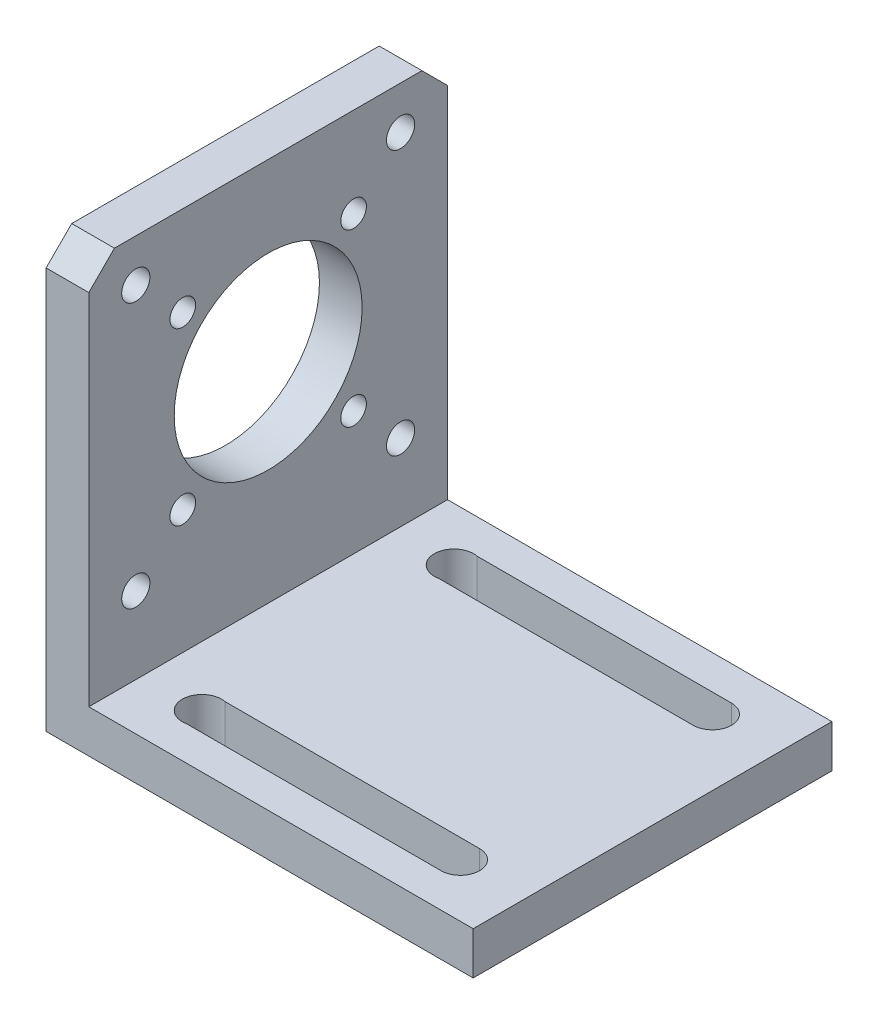
ISO-10303-21;
HEADER;
FILE_DESCRIPTION(('STEP AP214'),'2;1');
FILE_NAME('part.step','',(''),(''),'','','');
FILE_SCHEMA(('AUTOMOTIVE_DESIGN { 1 0 10303 214 1 1 1 1 }'));
ENDSEC;
DATA;
#1=APPLICATION_CONTEXT('core data for automotive mechanical design processes');
#2=APPLICATION_PROTOCOL_DEFINITION('international standard','automotive_design',2000,#1);
#3=PRODUCT_CONTEXT('',#1,'mechanical');
#4=PRODUCT('Part','Part','',(#3));
#5=PRODUCT_RELATED_PRODUCT_CATEGORY('part','',(#4));
#6=PRODUCT_DEFINITION_FORMATION('','',#4);
#7=PRODUCT_DEFINITION_CONTEXT('part definition',#1,'design');
#8=PRODUCT_DEFINITION('design','',#6,#7);
#9=PRODUCT_DEFINITION_SHAPE('','',#8);
#10=(LENGTH_UNIT() NAMED_UNIT(*) SI_UNIT(.MILLI.,.METRE.));
#11=(NAMED_UNIT(*) PLANE_ANGLE_UNIT() SI_UNIT($,.RADIAN.));
#12=(NAMED_UNIT(*) SI_UNIT($,.STERADIAN.) SOLID_ANGLE_UNIT());
#13=UNCERTAINTY_MEASURE_WITH_UNIT(LENGTH_MEASURE(1.E-05),#10,'distance_accuracy_value','');
#14=(GEOMETRIC_REPRESENTATION_CONTEXT(3) GLOBAL_UNCERTAINTY_ASSIGNED_CONTEXT((#13)) GLOBAL_UNIT_ASSIGNED_CONTEXT((#10,
#11,#12)) REPRESENTATION_CONTEXT('',''));
#15=CARTESIAN_POINT('',(0.,0.,0.));
#16=DIRECTION('',(0.,0.,1.));
#17=DIRECTION('',(1.,0.,0.));
#18=AXIS2_PLACEMENT_3D('',#15,#16,#17);
#19=CARTESIAN_POINT('',(0.,5.,0.));
#20=DIRECTION('',(0.,-1.,0.));
#21=DIRECTION('',(0.,0.,-1.));
#22=AXIS2_PLACEMENT_3D('',#19,#20,#21);
#23=PLANE('',#22);
#24=DIRECTION('',(0.,0.,-1.));
#25=VECTOR('',#24,1.);
#26=CARTESIAN_POINT('',(5.,5.,0.));
#27=LINE('',#26,#25);
#28=CARTESIAN_POINT('',(5.,5.,0.));
#29=VERTEX_POINT('',#28);
#30=CARTESIAN_POINT('',(5.,5.,-42.));
#31=VERTEX_POINT('',#30);
#32=EDGE_CURVE('E224',#29,#31,#27,.T.);
#33=ORIENTED_EDGE('',*,*,#32,.F.);
#34=DIRECTION('',(1.,0.,0.));
#35=VECTOR('',#34,1.);
#36=CARTESIAN_POINT('',(0.,5.,0.));
#37=LINE('',#36,#35);
#38=CARTESIAN_POINT('',(50.,5.,0.));
#39=VERTEX_POINT('',#38);
#40=EDGE_CURVE('E306',#29,#39,#37,.T.);
#41=ORIENTED_EDGE('',*,*,#40,.T.);
#42=DIRECTION('',(0.,0.,-1.));
#43=VECTOR('',#42,1.);
#44=CARTESIAN_POINT('',(50.,5.,0.));
#45=LINE('',#44,#43);
#46=CARTESIAN_POINT('',(50.,5.,-42.));
#47=VERTEX_POINT('',#46);
#48=EDGE_CURVE('E266',#39,#47,#45,.T.);
#49=ORIENTED_EDGE('',*,*,#48,.T.);
#50=DIRECTION('',(-1.,0.,0.));
#51=VECTOR('',#50,1.);
#52=CARTESIAN_POINT('',(0.,5.,-42.));
#53=LINE('',#52,#51);
#54=EDGE_CURVE('E237',#47,#31,#53,.T.);
#55=ORIENTED_EDGE('',*,*,#54,.T.);
#56=EDGE_LOOP('',(#33,#41,#49,#55));
#57=FACE_BOUND('',#56,.T.);
#58=DIRECTION('',(-1.,0.,0.));
#59=VECTOR('',#58,1.);
#60=CARTESIAN_POINT('',(42.25,5.,-4.));
#61=LINE('',#60,#59);
#62=CARTESIAN_POINT('',(42.25,5.,-4.));
#63=VERTEX_POINT('',#62);
#64=CARTESIAN_POINT('',(12.4715814843413,5.,-4.));
#65=VERTEX_POINT('',#64);
#66=EDGE_CURVE('E193',#63,#65,#61,.T.);
#67=ORIENTED_EDGE('',*,*,#66,.T.);
#68=CARTESIAN_POINT('',(12.,5.,-6.25));
#69=DIRECTION('',(0.,1.,0.));
#70=DIRECTION('',(0.,0.,1.));
#71=AXIS2_PLACEMENT_3D('',#68,#69,#70);
#72=CIRCLE('',#71,2.29888866550198);
#73=CARTESIAN_POINT('',(12.4715814843413,5.,-8.5));
#74=VERTEX_POINT('',#73);
#75=EDGE_CURVE('E173',#74,#65,#72,.T.);
#76=ORIENTED_EDGE('',*,*,#75,.F.);
#77=DIRECTION('',(1.,0.,0.));
#78=VECTOR('',#77,1.);
#79=CARTESIAN_POINT('',(12.4715814843413,5.,-8.5));
#80=LINE('',#79,#78);
#81=CARTESIAN_POINT('',(42.25,5.,-8.5));
#82=VERTEX_POINT('',#81);
#83=EDGE_CURVE('E184',#74,#82,#80,.T.);
#84=ORIENTED_EDGE('',*,*,#83,.T.);
#85=CARTESIAN_POINT('',(42.25,5.,-6.25));
#86=DIRECTION('',(0.,-1.,0.));
#87=DIRECTION('',(0.,0.,-1.));
#88=AXIS2_PLACEMENT_3D('',#85,#86,#87);
#89=CIRCLE('',#88,2.25);
#90=EDGE_CURVE('E196',#82,#63,#89,.T.);
#91=ORIENTED_EDGE('',*,*,#90,.T.);
#92=EDGE_LOOP('',(#67,#76,#84,#91));
#93=FACE_BOUND('',#92,.T.);
#94=CARTESIAN_POINT('',(42.2499999999999,5.,-35.75));
#95=DIRECTION('',(0.,-1.,0.));
#96=DIRECTION('',(0.,0.,-1.));
#97=AXIS2_PLACEMENT_3D('',#94,#95,#96);
#98=CIRCLE('',#97,2.25);
#99=CARTESIAN_POINT('',(42.2499999999999,5.,-38.));
#100=VERTEX_POINT('',#99);
#101=CARTESIAN_POINT('',(42.2499999999999,5.,-33.5));
#102=VERTEX_POINT('',#101);
#103=EDGE_CURVE('E51',#100,#102,#98,.T.);
#104=ORIENTED_EDGE('',*,*,#103,.T.);
#105=DIRECTION('',(-1.,0.,0.));
#106=VECTOR('',#105,1.);
#107=CARTESIAN_POINT('',(42.2499999999999,5.,-33.5));
#108=LINE('',#107,#106);
#109=CARTESIAN_POINT('',(12.4715814843411,5.,-33.5));
#110=VERTEX_POINT('',#109);
#111=EDGE_CURVE('E167',#102,#110,#108,.T.);
#112=ORIENTED_EDGE('',*,*,#111,.T.);
#113=CARTESIAN_POINT('',(11.9999999999999,5.,-35.75));
#114=DIRECTION('',(0.,1.,0.));
#115=DIRECTION('',(0.,0.,1.));
#116=AXIS2_PLACEMENT_3D('',#113,#114,#115);
#117=CIRCLE('',#116,2.29888866550198);
#118=CARTESIAN_POINT('',(12.4715814843411,5.,-38.));
#119=VERTEX_POINT('',#118);
#120=EDGE_CURVE('E154',#119,#110,#117,.T.);
#121=ORIENTED_EDGE('',*,*,#120,.F.);
#122=DIRECTION('',(1.,0.,0.));
#123=VECTOR('',#122,1.);
#124=CARTESIAN_POINT('',(12.4715814843411,5.,-38.));
#125=LINE('',#124,#123);
#126=EDGE_CURVE('E162',#119,#100,#125,.T.);
#127=ORIENTED_EDGE('',*,*,#126,.T.);
#128=EDGE_LOOP('',(#104,#112,#121,#127));
#129=FACE_BOUND('',#128,.T.);
#130=ADVANCED_FACE('F34',(#57,#93,#129),#23,.F.);
#131=CARTESIAN_POINT('',(0.,0.,0.));
#132=DIRECTION('',(0.,-1.,0.));
#133=DIRECTION('',(0.,0.,-1.));
#134=AXIS2_PLACEMENT_3D('',#131,#132,#133);
#135=PLANE('',#134);
#136=DIRECTION('',(0.,0.,1.));
#137=VECTOR('',#136,1.);
#138=CARTESIAN_POINT('',(0.,0.,0.));
#139=LINE('',#138,#137);
#140=CARTESIAN_POINT('',(0.,0.,-42.));
#141=VERTEX_POINT('',#140);
#142=CARTESIAN_POINT('',(0.,0.,0.));
#143=VERTEX_POINT('',#142);
#144=EDGE_CURVE('E246',#141,#143,#139,.T.);
#145=ORIENTED_EDGE('',*,*,#144,.F.);
#146=DIRECTION('',(-1.,0.,0.));
#147=VECTOR('',#146,1.);
#148=CARTESIAN_POINT('',(0.,0.,-42.));
#149=LINE('',#148,#147);
#150=CARTESIAN_POINT('',(50.,0.,-42.));
#151=VERTEX_POINT('',#150);
#152=EDGE_CURVE('E309',#151,#141,#149,.T.);
#153=ORIENTED_EDGE('',*,*,#152,.F.);
#154=DIRECTION('',(0.,0.,-1.));
#155=VECTOR('',#154,1.);
#156=CARTESIAN_POINT('',(50.,0.,0.));
#157=LINE('',#156,#155);
#158=CARTESIAN_POINT('',(50.,0.,0.));
#159=VERTEX_POINT('',#158);
#160=EDGE_CURVE('E311',#159,#151,#157,.T.);
#161=ORIENTED_EDGE('',*,*,#160,.F.);
#162=DIRECTION('',(1.,0.,0.));
#163=VECTOR('',#162,1.);
#164=CARTESIAN_POINT('',(0.,0.,0.));
#165=LINE('',#164,#163);
#166=EDGE_CURVE('E252',#143,#159,#165,.T.);
#167=ORIENTED_EDGE('',*,*,#166,.F.);
#168=EDGE_LOOP('',(#145,#153,#161,#167));
#169=FACE_BOUND('',#168,.T.);
#170=CARTESIAN_POINT('',(12.,0.,-6.25));
#171=DIRECTION('',(0.,1.,0.));
#172=DIRECTION('',(0.,0.,1.));
#173=AXIS2_PLACEMENT_3D('',#170,#171,#172);
#174=CIRCLE('',#173,2.29888866550198);
#175=CARTESIAN_POINT('',(12.4715814843413,0.,-8.5));
#176=VERTEX_POINT('',#175);
#177=CARTESIAN_POINT('',(12.4715814843413,0.,-4.));
#178=VERTEX_POINT('',#177);
#179=EDGE_CURVE('E180',#176,#178,#174,.T.);
#180=ORIENTED_EDGE('',*,*,#179,.T.);
#181=DIRECTION('',(-1.,0.,0.));
#182=VECTOR('',#181,1.);
#183=CARTESIAN_POINT('',(42.25,0.,-4.));
#184=LINE('',#183,#182);
#185=CARTESIAN_POINT('',(42.25,0.,-4.));
#186=VERTEX_POINT('',#185);
#187=EDGE_CURVE('E183',#186,#178,#184,.T.);
#188=ORIENTED_EDGE('',*,*,#187,.F.);
#189=CARTESIAN_POINT('',(42.25,0.,-6.25));
#190=DIRECTION('',(0.,-1.,0.));
#191=DIRECTION('',(0.,0.,-1.));
#192=AXIS2_PLACEMENT_3D('',#189,#190,#191);
#193=CIRCLE('',#192,2.25);
#194=CARTESIAN_POINT('',(42.25,0.,-8.5));
#195=VERTEX_POINT('',#194);
#196=EDGE_CURVE('E186',#195,#186,#193,.T.);
#197=ORIENTED_EDGE('',*,*,#196,.F.);
#198=DIRECTION('',(1.,0.,0.));
#199=VECTOR('',#198,1.);
#200=CARTESIAN_POINT('',(12.4715814843413,0.,-8.5));
#201=LINE('',#200,#199);
#202=EDGE_CURVE('E189',#176,#195,#201,.T.);
#203=ORIENTED_EDGE('',*,*,#202,.F.);
#204=EDGE_LOOP('',(#180,#188,#197,#203));
#205=FACE_BOUND('',#204,.T.);
#206=DIRECTION('',(-1.,0.,0.));
#207=VECTOR('',#206,1.);
#208=CARTESIAN_POINT('',(42.2499999999999,0.,-33.5));
#209=LINE('',#208,#207);
#210=CARTESIAN_POINT('',(42.2499999999999,0.,-33.5));
#211=VERTEX_POINT('',#210);
#212=CARTESIAN_POINT('',(12.4715814843411,0.,-33.5));
#213=VERTEX_POINT('',#212);
#214=EDGE_CURVE('E177',#211,#213,#209,.T.);
#215=ORIENTED_EDGE('',*,*,#214,.F.);
#216=CARTESIAN_POINT('',(42.2499999999999,0.,-35.75));
#217=DIRECTION('',(0.,-1.,0.));
#218=DIRECTION('',(0.,0.,-1.));
#219=AXIS2_PLACEMENT_3D('',#216,#217,#218);
#220=CIRCLE('',#219,2.25);
#221=CARTESIAN_POINT('',(42.2499999999999,0.,-38.));
#222=VERTEX_POINT('',#221);
#223=EDGE_CURVE('E165',#222,#211,#220,.T.);
#224=ORIENTED_EDGE('',*,*,#223,.F.);
#225=DIRECTION('',(1.,0.,0.));
#226=VECTOR('',#225,1.);
#227=CARTESIAN_POINT('',(12.4715814843411,0.,-38.));
#228=LINE('',#227,#226);
#229=CARTESIAN_POINT('',(12.4715814843411,0.,-38.));
#230=VERTEX_POINT('',#229);
#231=EDGE_CURVE('E174',#230,#222,#228,.T.);
#232=ORIENTED_EDGE('',*,*,#231,.F.);
#233=CARTESIAN_POINT('',(11.9999999999999,0.,-35.75));
#234=DIRECTION('',(0.,1.,0.));
#235=DIRECTION('',(0.,0.,1.));
#236=AXIS2_PLACEMENT_3D('',#233,#234,#235);
#237=CIRCLE('',#236,2.29888866550198);
#238=EDGE_CURVE('E59',#230,#213,#237,.T.);
#239=ORIENTED_EDGE('',*,*,#238,.T.);
#240=EDGE_LOOP('',(#215,#224,#232,#239));
#241=FACE_BOUND('',#240,.T.);
#242=ADVANCED_FACE('F287',(#169,#205,#241),#135,.T.);
#243=CARTESIAN_POINT('',(0.,5.,0.));
#244=DIRECTION('',(1.,0.,0.));
#245=DIRECTION('',(0.,0.,-1.));
#246=AXIS2_PLACEMENT_3D('',#243,#244,#245);
#247=PLANE('',#246);
#248=CARTESIAN_POINT('',(0.,45.,-36.5));
#249=DIRECTION('',(1.,0.,0.));
#250=DIRECTION('',(0.,0.,-1.));
#251=AXIS2_PLACEMENT_3D('',#248,#249,#250);
#252=CIRCLE('',#251,1.65);
#253=CARTESIAN_POINT('',(0.,45.,-38.15));
#254=VERTEX_POINT('',#253);
#255=EDGE_CURVE('E409',#254,#254,#252,.T.);
#256=ORIENTED_EDGE('',*,*,#255,.T.);
#257=EDGE_LOOP('',(#256));
#258=FACE_BOUND('',#257,.T.);
#259=CARTESIAN_POINT('',(0.,39.5,-11.));
#260=DIRECTION('',(1.,0.,0.));
#261=DIRECTION('',(0.,0.,-1.));
#262=AXIS2_PLACEMENT_3D('',#259,#260,#261);
#263=CIRCLE('',#262,1.49999999999999);
#264=CARTESIAN_POINT('',(0.,39.5,-12.5));
#265=VERTEX_POINT('',#264);
#266=EDGE_CURVE('E416',#265,#265,#263,.T.);
#267=ORIENTED_EDGE('',*,*,#266,.T.);
#268=EDGE_LOOP('',(#267));
#269=FACE_BOUND('',#268,.T.);
#270=CARTESIAN_POINT('',(0.,19.5,-11.));
#271=DIRECTION('',(1.,0.,0.));
#272=DIRECTION('',(0.,0.,-1.));
#273=AXIS2_PLACEMENT_3D('',#270,#271,#272);
#274=CIRCLE('',#273,1.5);
#275=CARTESIAN_POINT('',(0.,19.5,-12.5));
#276=VERTEX_POINT('',#275);
#277=EDGE_CURVE('E422',#276,#276,#274,.T.);
#278=ORIENTED_EDGE('',*,*,#277,.T.);
#279=EDGE_LOOP('',(#278));
#280=FACE_BOUND('',#279,.T.);
#281=CARTESIAN_POINT('',(0.,19.5,-31.));
#282=DIRECTION('',(1.,0.,0.));
#283=DIRECTION('',(0.,0.,-1.));
#284=AXIS2_PLACEMENT_3D('',#281,#282,#283);
#285=CIRCLE('',#284,1.5);
#286=CARTESIAN_POINT('',(0.,19.5,-32.5));
#287=VERTEX_POINT('',#286);
#288=EDGE_CURVE('E428',#287,#287,#285,.T.);
#289=ORIENTED_EDGE('',*,*,#288,.T.);
#290=EDGE_LOOP('',(#289));
#291=FACE_BOUND('',#290,.T.);
#292=CARTESIAN_POINT('',(0.,14.,-36.5));
#293=DIRECTION('',(1.,0.,0.));
#294=DIRECTION('',(0.,0.,-1.));
#295=AXIS2_PLACEMENT_3D('',#292,#293,#294);
#296=CIRCLE('',#295,1.65);
#297=CARTESIAN_POINT('',(0.,14.,-38.15));
#298=VERTEX_POINT('',#297);
#299=EDGE_CURVE('E434',#298,#298,#296,.T.);
#300=ORIENTED_EDGE('',*,*,#299,.T.);
#301=EDGE_LOOP('',(#300));
#302=FACE_BOUND('',#301,.T.);
#303=CARTESIAN_POINT('',(0.,39.5,-31.));
#304=DIRECTION('',(1.,0.,0.));
#305=DIRECTION('',(0.,0.,-1.));
#306=AXIS2_PLACEMENT_3D('',#303,#304,#305);
#307=CIRCLE('',#306,1.5);
#308=CARTESIAN_POINT('',(0.,39.5,-32.5));
#309=VERTEX_POINT('',#308);
#310=EDGE_CURVE('E440',#309,#309,#307,.T.);
#311=ORIENTED_EDGE('',*,*,#310,.T.);
#312=EDGE_LOOP('',(#311));
#313=FACE_BOUND('',#312,.T.);
#314=CARTESIAN_POINT('',(0.,14.,-5.5));
#315=DIRECTION('',(1.,0.,0.));
#316=DIRECTION('',(0.,0.,-1.));
#317=AXIS2_PLACEMENT_3D('',#314,#315,#316);
#318=CIRCLE('',#317,1.65);
#319=CARTESIAN_POINT('',(0.,14.,-7.15));
#320=VERTEX_POINT('',#319);
#321=EDGE_CURVE('E446',#320,#320,#318,.T.);
#322=ORIENTED_EDGE('',*,*,#321,.T.);
#323=EDGE_LOOP('',(#322));
#324=FACE_BOUND('',#323,.T.);
#325=CARTESIAN_POINT('',(0.,45.,-5.5));
#326=DIRECTION('',(1.,0.,0.));
#327=DIRECTION('',(0.,0.,-1.));
#328=AXIS2_PLACEMENT_3D('',#325,#326,#327);
#329=CIRCLE('',#328,1.65);
#330=CARTESIAN_POINT('',(0.,45.,-7.15));
#331=VERTEX_POINT('',#330);
#332=EDGE_CURVE('E452',#331,#331,#329,.T.);
#333=ORIENTED_EDGE('',*,*,#332,.T.);
#334=EDGE_LOOP('',(#333));
#335=FACE_BOUND('',#334,.T.);
#336=CARTESIAN_POINT('',(0.,29.5,-21.));
#337=DIRECTION('',(1.,0.,0.));
#338=DIRECTION('',(0.,0.,-1.));
#339=AXIS2_PLACEMENT_3D('',#336,#337,#338);
#340=CIRCLE('',#339,11.);
#341=CARTESIAN_POINT('',(0.,29.5,-32.));
#342=VERTEX_POINT('',#341);
#343=EDGE_CURVE('E458',#342,#342,#340,.T.);
#344=ORIENTED_EDGE('',*,*,#343,.T.);
#345=EDGE_LOOP('',(#344));
#346=FACE_BOUND('',#345,.T.);
#347=DIRECTION('',(0.,0.,1.));
#348=VECTOR('',#347,1.);
#349=CARTESIAN_POINT('',(0.,50.,0.));
#350=LINE('',#349,#348);
#351=CARTESIAN_POINT('',(0.,50.,-39.));
#352=VERTEX_POINT('',#351);
#353=CARTESIAN_POINT('',(0.,50.,-3.));
#354=VERTEX_POINT('',#353);
#355=EDGE_CURVE('E225',#352,#354,#350,.T.);
#356=ORIENTED_EDGE('',*,*,#355,.F.);
#357=DIRECTION('',(0.,-0.707106781186548,-0.707106781186548));
#358=VECTOR('',#357,1.);
#359=CARTESIAN_POINT('',(0.,47.,-42.));
#360=LINE('',#359,#358);
#361=CARTESIAN_POINT('',(0.,47.,-42.));
#362=VERTEX_POINT('',#361);
#363=EDGE_CURVE('E214',#352,#362,#360,.T.);
#364=ORIENTED_EDGE('',*,*,#363,.T.);
#365=DIRECTION('',(0.,-1.,0.));
#366=VECTOR('',#365,1.);
#367=CARTESIAN_POINT('',(0.,5.,-42.));
#368=LINE('',#367,#366);
#369=EDGE_CURVE('E268',#362,#141,#368,.T.);
#370=ORIENTED_EDGE('',*,*,#369,.T.);
#371=ORIENTED_EDGE('',*,*,#144,.T.);
#372=DIRECTION('',(0.,-1.,0.));
#373=VECTOR('',#372,1.);
#374=CARTESIAN_POINT('',(0.,5.,0.));
#375=LINE('',#374,#373);
#376=CARTESIAN_POINT('',(0.,47.,0.));
#377=VERTEX_POINT('',#376);
#378=EDGE_CURVE('E314',#377,#143,#375,.T.);
#379=ORIENTED_EDGE('',*,*,#378,.F.);
#380=DIRECTION('',(0.,0.707106781186548,-0.707106781186547));
#381=VECTOR('',#380,1.);
#382=CARTESIAN_POINT('',(0.,26.,21.));
#383=LINE('',#382,#381);
#384=EDGE_CURVE('E221',#377,#354,#383,.T.);
#385=ORIENTED_EDGE('',*,*,#384,.T.);
#386=EDGE_LOOP('',(#356,#364,#370,#371,#379,#385));
#387=FACE_BOUND('',#386,.T.);
#388=ADVANCED_FACE('F36',(#258,#269,#280,#291,#302,#313,#324,#335,#346,#387),#247,.F.);
#389=CARTESIAN_POINT('',(0.,5.,0.));
#390=DIRECTION('',(0.,0.,-1.));
#391=DIRECTION('',(-1.,0.,0.));
#392=AXIS2_PLACEMENT_3D('',#389,#390,#391);
#393=PLANE('',#392);
#394=DIRECTION('',(0.,-1.,0.));
#395=VECTOR('',#394,1.);
#396=CARTESIAN_POINT('',(5.,50.,0.));
#397=LINE('',#396,#395);
#398=CARTESIAN_POINT('',(5.,47.,0.));
#399=VERTEX_POINT('',#398);
#400=EDGE_CURVE('E245',#399,#29,#397,.T.);
#401=ORIENTED_EDGE('',*,*,#400,.F.);
#402=DIRECTION('',(1.,0.,0.));
#403=VECTOR('',#402,1.);
#404=CARTESIAN_POINT('',(-40.,47.,0.));
#405=LINE('',#404,#403);
#406=EDGE_CURVE('E219',#377,#399,#405,.T.);
#407=ORIENTED_EDGE('',*,*,#406,.F.);
#408=ORIENTED_EDGE('',*,*,#378,.T.);
#409=ORIENTED_EDGE('',*,*,#166,.T.);
#410=DIRECTION('',(0.,-1.,0.));
#411=VECTOR('',#410,1.);
#412=CARTESIAN_POINT('',(50.,5.,0.));
#413=LINE('',#412,#411);
#414=EDGE_CURVE('E308',#39,#159,#413,.T.);
#415=ORIENTED_EDGE('',*,*,#414,.F.);
#416=ORIENTED_EDGE('',*,*,#40,.F.);
#417=EDGE_LOOP('',(#401,#407,#408,#409,#415,#416));
#418=FACE_BOUND('',#417,.T.);
#419=ADVANCED_FACE('F295',(#418),#393,.F.);
#420=CARTESIAN_POINT('',(50.,5.,0.));
#421=DIRECTION('',(-1.,0.,0.));
#422=DIRECTION('',(0.,0.,1.));
#423=AXIS2_PLACEMENT_3D('',#420,#421,#422);
#424=PLANE('',#423);
#425=ORIENTED_EDGE('',*,*,#160,.T.);
#426=DIRECTION('',(0.,-1.,0.));
#427=VECTOR('',#426,1.);
#428=CARTESIAN_POINT('',(50.,5.,-42.));
#429=LINE('',#428,#427);
#430=EDGE_CURVE('E317',#47,#151,#429,.T.);
#431=ORIENTED_EDGE('',*,*,#430,.F.);
#432=ORIENTED_EDGE('',*,*,#48,.F.);
#433=ORIENTED_EDGE('',*,*,#414,.T.);
#434=EDGE_LOOP('',(#425,#431,#432,#433));
#435=FACE_BOUND('',#434,.T.);
#436=ADVANCED_FACE('F281',(#435),#424,.F.);
#437=CARTESIAN_POINT('',(0.,5.,-42.));
#438=DIRECTION('',(0.,0.,1.));
#439=DIRECTION('',(1.,0.,0.));
#440=AXIS2_PLACEMENT_3D('',#437,#438,#439);
#441=PLANE('',#440);
#442=ORIENTED_EDGE('',*,*,#369,.F.);
#443=DIRECTION('',(1.,0.,0.));
#444=VECTOR('',#443,1.);
#445=CARTESIAN_POINT('',(-40.,47.,-42.));
#446=LINE('',#445,#444);
#447=CARTESIAN_POINT('',(5.,47.,-42.));
#448=VERTEX_POINT('',#447);
#449=EDGE_CURVE('E211',#362,#448,#446,.T.);
#450=ORIENTED_EDGE('',*,*,#449,.T.);
#451=DIRECTION('',(0.,-1.,0.));
#452=VECTOR('',#451,1.);
#453=CARTESIAN_POINT('',(5.,50.,-42.));
#454=LINE('',#453,#452);
#455=EDGE_CURVE('E38',#448,#31,#454,.T.);
#456=ORIENTED_EDGE('',*,*,#455,.T.);
#457=ORIENTED_EDGE('',*,*,#54,.F.);
#458=ORIENTED_EDGE('',*,*,#430,.T.);
#459=ORIENTED_EDGE('',*,*,#152,.T.);
#460=EDGE_LOOP('',(#442,#450,#456,#457,#458,#459));
#461=FACE_BOUND('',#460,.T.);
#462=ADVANCED_FACE('F259',(#461),#441,.F.);
#463=CARTESIAN_POINT('',(5.,50.,0.));
#464=DIRECTION('',(-1.,0.,0.));
#465=DIRECTION('',(0.,0.,1.));
#466=AXIS2_PLACEMENT_3D('',#463,#464,#465);
#467=PLANE('',#466);
#468=CARTESIAN_POINT('',(5.,45.,-36.5));
#469=DIRECTION('',(1.,0.,0.));
#470=DIRECTION('',(0.,0.,-1.));
#471=AXIS2_PLACEMENT_3D('',#468,#469,#470);
#472=CIRCLE('',#471,1.65);
#473=CARTESIAN_POINT('',(5.,45.,-38.15));
#474=VERTEX_POINT('',#473);
#475=EDGE_CURVE('E411',#474,#474,#472,.T.);
#476=ORIENTED_EDGE('',*,*,#475,.F.);
#477=EDGE_LOOP('',(#476));
#478=FACE_BOUND('',#477,.T.);
#479=CARTESIAN_POINT('',(5.,39.5,-11.));
#480=DIRECTION('',(1.,0.,0.));
#481=DIRECTION('',(0.,0.,-1.));
#482=AXIS2_PLACEMENT_3D('',#479,#480,#481);
#483=CIRCLE('',#482,1.49999999999999);
#484=CARTESIAN_POINT('',(5.,39.5,-12.5));
#485=VERTEX_POINT('',#484);
#486=EDGE_CURVE('E413',#485,#485,#483,.T.);
#487=ORIENTED_EDGE('',*,*,#486,.F.);
#488=EDGE_LOOP('',(#487));
#489=FACE_BOUND('',#488,.T.);
#490=CARTESIAN_POINT('',(5.,19.5,-11.));
#491=DIRECTION('',(1.,0.,0.));
#492=DIRECTION('',(0.,0.,-1.));
#493=AXIS2_PLACEMENT_3D('',#490,#491,#492);
#494=CIRCLE('',#493,1.5);
#495=CARTESIAN_POINT('',(5.,19.5,-12.5));
#496=VERTEX_POINT('',#495);
#497=EDGE_CURVE('E419',#496,#496,#494,.T.);
#498=ORIENTED_EDGE('',*,*,#497,.F.);
#499=EDGE_LOOP('',(#498));
#500=FACE_BOUND('',#499,.T.);
#501=CARTESIAN_POINT('',(5.,19.5,-31.));
#502=DIRECTION('',(1.,0.,0.));
#503=DIRECTION('',(0.,0.,-1.));
#504=AXIS2_PLACEMENT_3D('',#501,#502,#503);
#505=CIRCLE('',#504,1.5);
#506=CARTESIAN_POINT('',(5.,19.5,-32.5));
#507=VERTEX_POINT('',#506);
#508=EDGE_CURVE('E425',#507,#507,#505,.T.);
#509=ORIENTED_EDGE('',*,*,#508,.F.);
#510=EDGE_LOOP('',(#509));
#511=FACE_BOUND('',#510,.T.);
#512=CARTESIAN_POINT('',(5.,14.,-36.5));
#513=DIRECTION('',(1.,0.,0.));
#514=DIRECTION('',(0.,0.,-1.));
#515=AXIS2_PLACEMENT_3D('',#512,#513,#514);
#516=CIRCLE('',#515,1.65);
#517=CARTESIAN_POINT('',(5.,14.,-38.15));
#518=VERTEX_POINT('',#517);
#519=EDGE_CURVE('E431',#518,#518,#516,.T.);
#520=ORIENTED_EDGE('',*,*,#519,.F.);
#521=EDGE_LOOP('',(#520));
#522=FACE_BOUND('',#521,.T.);
#523=CARTESIAN_POINT('',(5.,39.5,-31.));
#524=DIRECTION('',(1.,0.,0.));
#525=DIRECTION('',(0.,0.,-1.));
#526=AXIS2_PLACEMENT_3D('',#523,#524,#525);
#527=CIRCLE('',#526,1.5);
#528=CARTESIAN_POINT('',(5.,39.5,-32.5));
#529=VERTEX_POINT('',#528);
#530=EDGE_CURVE('E437',#529,#529,#527,.T.);
#531=ORIENTED_EDGE('',*,*,#530,.F.);
#532=EDGE_LOOP('',(#531));
#533=FACE_BOUND('',#532,.T.);
#534=CARTESIAN_POINT('',(5.,14.,-5.5));
#535=DIRECTION('',(1.,0.,0.));
#536=DIRECTION('',(0.,0.,-1.));
#537=AXIS2_PLACEMENT_3D('',#534,#535,#536);
#538=CIRCLE('',#537,1.65);
#539=CARTESIAN_POINT('',(5.,14.,-7.15));
#540=VERTEX_POINT('',#539);
#541=EDGE_CURVE('E443',#540,#540,#538,.T.);
#542=ORIENTED_EDGE('',*,*,#541,.F.);
#543=EDGE_LOOP('',(#542));
#544=FACE_BOUND('',#543,.T.);
#545=CARTESIAN_POINT('',(5.,45.,-5.5));
#546=DIRECTION('',(1.,0.,0.));
#547=DIRECTION('',(0.,0.,-1.));
#548=AXIS2_PLACEMENT_3D('',#545,#546,#547);
#549=CIRCLE('',#548,1.65);
#550=CARTESIAN_POINT('',(5.,45.,-7.15));
#551=VERTEX_POINT('',#550);
#552=EDGE_CURVE('E449',#551,#551,#549,.T.);
#553=ORIENTED_EDGE('',*,*,#552,.F.);
#554=EDGE_LOOP('',(#553));
#555=FACE_BOUND('',#554,.T.);
#556=CARTESIAN_POINT('',(5.,29.5,-21.));
#557=DIRECTION('',(1.,0.,0.));
#558=DIRECTION('',(0.,0.,-1.));
#559=AXIS2_PLACEMENT_3D('',#556,#557,#558);
#560=CIRCLE('',#559,11.);
#561=CARTESIAN_POINT('',(5.,29.5,-32.));
#562=VERTEX_POINT('',#561);
#563=EDGE_CURVE('E455',#562,#562,#560,.T.);
#564=ORIENTED_EDGE('',*,*,#563,.F.);
#565=EDGE_LOOP('',(#564));
#566=FACE_BOUND('',#565,.T.);
#567=ORIENTED_EDGE('',*,*,#455,.F.);
#568=DIRECTION('',(0.,-0.707106781186547,-0.707106781186547));
#569=VECTOR('',#568,1.);
#570=CARTESIAN_POINT('',(5.,50.,-39.));
#571=LINE('',#570,#569);
#572=CARTESIAN_POINT('',(5.,50.,-39.));
#573=VERTEX_POINT('',#572);
#574=EDGE_CURVE('E203',#573,#448,#571,.T.);
#575=ORIENTED_EDGE('',*,*,#574,.F.);
#576=DIRECTION('',(0.,0.,-1.));
#577=VECTOR('',#576,1.);
#578=CARTESIAN_POINT('',(5.,50.,0.));
#579=LINE('',#578,#577);
#580=CARTESIAN_POINT('',(5.,50.,-3.));
#581=VERTEX_POINT('',#580);
#582=EDGE_CURVE('E227',#581,#573,#579,.T.);
#583=ORIENTED_EDGE('',*,*,#582,.F.);
#584=DIRECTION('',(0.,0.707106781186548,-0.707106781186547));
#585=VECTOR('',#584,1.);
#586=CARTESIAN_POINT('',(5.,47.,0.));
#587=LINE('',#586,#585);
#588=EDGE_CURVE('E217',#399,#581,#587,.T.);
#589=ORIENTED_EDGE('',*,*,#588,.F.);
#590=ORIENTED_EDGE('',*,*,#400,.T.);
#591=ORIENTED_EDGE('',*,*,#32,.T.);
#592=EDGE_LOOP('',(#567,#575,#583,#589,#590,#591));
#593=FACE_BOUND('',#592,.T.);
#594=ADVANCED_FACE('F269',(#478,#489,#500,#511,#522,#533,#544,#555,#566,#593),#467,.F.);
#595=CARTESIAN_POINT('',(0.,50.,0.));
#596=DIRECTION('',(0.,-1.,0.));
#597=DIRECTION('',(0.,0.,-1.));
#598=AXIS2_PLACEMENT_3D('',#595,#596,#597);
#599=PLANE('',#598);
#600=ORIENTED_EDGE('',*,*,#582,.T.);
#601=DIRECTION('',(-1.,0.,0.));
#602=VECTOR('',#601,1.);
#603=CARTESIAN_POINT('',(0.,50.,-39.));
#604=LINE('',#603,#602);
#605=EDGE_CURVE('E11',#573,#352,#604,.T.);
#606=ORIENTED_EDGE('',*,*,#605,.T.);
#607=ORIENTED_EDGE('',*,*,#355,.T.);
#608=DIRECTION('',(1.,0.,0.));
#609=VECTOR('',#608,1.);
#610=CARTESIAN_POINT('',(0.,50.,-3.));
#611=LINE('',#610,#609);
#612=EDGE_CURVE('E44',#354,#581,#611,.T.);
#613=ORIENTED_EDGE('',*,*,#612,.T.);
#614=EDGE_LOOP('',(#600,#606,#607,#613));
#615=FACE_BOUND('',#614,.T.);
#616=ADVANCED_FACE('F271',(#615),#599,.F.);
#617=CARTESIAN_POINT('',(-40.,47.,0.));
#618=DIRECTION('',(0.,-0.707106781186547,-0.707106781186548));
#619=DIRECTION('',(0.,0.707106781186548,-0.707106781186547));
#620=AXIS2_PLACEMENT_3D('',#617,#618,#619);
#621=PLANE('',#620);
#622=ORIENTED_EDGE('',*,*,#406,.T.);
#623=ORIENTED_EDGE('',*,*,#588,.T.);
#624=ORIENTED_EDGE('',*,*,#612,.F.);
#625=ORIENTED_EDGE('',*,*,#384,.F.);
#626=EDGE_LOOP('',(#622,#623,#624,#625));
#627=FACE_BOUND('',#626,.T.);
#628=ADVANCED_FACE('F278',(#627),#621,.F.);
#629=CARTESIAN_POINT('',(-40.,50.,-39.));
#630=DIRECTION('',(0.,-0.707106781186547,0.707106781186547));
#631=DIRECTION('',(0.,-0.707106781186548,-0.707106781186548));
#632=AXIS2_PLACEMENT_3D('',#629,#630,#631);
#633=PLANE('',#632);
#634=ORIENTED_EDGE('',*,*,#605,.F.);
#635=ORIENTED_EDGE('',*,*,#574,.T.);
#636=ORIENTED_EDGE('',*,*,#449,.F.);
#637=ORIENTED_EDGE('',*,*,#363,.F.);
#638=EDGE_LOOP('',(#634,#635,#636,#637));
#639=FACE_BOUND('',#638,.T.);
#640=ADVANCED_FACE('F330',(#639),#633,.F.);
#641=CARTESIAN_POINT('',(12.,0.,-6.25));
#642=DIRECTION('',(0.,1.,0.));
#643=DIRECTION('',(0.,0.,1.));
#644=AXIS2_PLACEMENT_3D('',#641,#642,#643);
#645=CYLINDRICAL_SURFACE('',#644,2.29888866550198);
#646=ORIENTED_EDGE('',*,*,#75,.T.);
#647=DIRECTION('',(0.,1.,0.));
#648=VECTOR('',#647,1.);
#649=CARTESIAN_POINT('',(12.4715814843413,0.,-4.));
#650=LINE('',#649,#648);
#651=EDGE_CURVE('E191',#178,#65,#650,.T.);
#652=ORIENTED_EDGE('',*,*,#651,.F.);
#653=ORIENTED_EDGE('',*,*,#179,.F.);
#654=DIRECTION('',(0.,1.,0.));
#655=VECTOR('',#654,1.);
#656=CARTESIAN_POINT('',(12.4715814843413,0.,-8.5));
#657=LINE('',#656,#655);
#658=EDGE_CURVE('E201',#176,#74,#657,.T.);
#659=ORIENTED_EDGE('',*,*,#658,.T.);
#660=EDGE_LOOP('',(#646,#652,#653,#659));
#661=FACE_BOUND('',#660,.T.);
#662=ADVANCED_FACE('F340',(#661),#645,.F.);
#663=CARTESIAN_POINT('',(12.4715814843413,0.,-8.5));
#664=DIRECTION('',(0.,0.,1.));
#665=DIRECTION('',(1.,0.,0.));
#666=AXIS2_PLACEMENT_3D('',#663,#664,#665);
#667=PLANE('',#666);
#668=ORIENTED_EDGE('',*,*,#83,.F.);
#669=ORIENTED_EDGE('',*,*,#658,.F.);
#670=ORIENTED_EDGE('',*,*,#202,.T.);
#671=DIRECTION('',(0.,1.,0.));
#672=VECTOR('',#671,1.);
#673=CARTESIAN_POINT('',(42.25,0.,-8.5));
#674=LINE('',#673,#672);
#675=EDGE_CURVE('E204',#195,#82,#674,.T.);
#676=ORIENTED_EDGE('',*,*,#675,.T.);
#677=EDGE_LOOP('',(#668,#669,#670,#676));
#678=FACE_BOUND('',#677,.T.);
#679=ADVANCED_FACE('F345',(#678),#667,.T.);
#680=CARTESIAN_POINT('',(42.25,0.,-6.25));
#681=DIRECTION('',(0.,1.,0.));
#682=DIRECTION('',(0.,0.,1.));
#683=AXIS2_PLACEMENT_3D('',#680,#681,#682);
#684=CYLINDRICAL_SURFACE('',#683,2.25);
#685=ORIENTED_EDGE('',*,*,#90,.F.);
#686=ORIENTED_EDGE('',*,*,#675,.F.);
#687=ORIENTED_EDGE('',*,*,#196,.T.);
#688=DIRECTION('',(0.,1.,0.));
#689=VECTOR('',#688,1.);
#690=CARTESIAN_POINT('',(42.25,0.,-4.));
#691=LINE('',#690,#689);
#692=EDGE_CURVE('E206',#186,#63,#691,.T.);
#693=ORIENTED_EDGE('',*,*,#692,.T.);
#694=EDGE_LOOP('',(#685,#686,#687,#693));
#695=FACE_BOUND('',#694,.T.);
#696=ADVANCED_FACE('F351',(#695),#684,.F.);
#697=CARTESIAN_POINT('',(42.25,0.,-4.));
#698=DIRECTION('',(0.,0.,-1.));
#699=DIRECTION('',(-1.,0.,0.));
#700=AXIS2_PLACEMENT_3D('',#697,#698,#699);
#701=PLANE('',#700);
#702=ORIENTED_EDGE('',*,*,#66,.F.);
#703=ORIENTED_EDGE('',*,*,#692,.F.);
#704=ORIENTED_EDGE('',*,*,#187,.T.);
#705=ORIENTED_EDGE('',*,*,#651,.T.);
#706=EDGE_LOOP('',(#702,#703,#704,#705));
#707=FACE_BOUND('',#706,.T.);
#708=ADVANCED_FACE('F347',(#707),#701,.T.);
#709=CARTESIAN_POINT('',(42.2499999999999,0.,-35.75));
#710=DIRECTION('',(0.,1.,0.));
#711=DIRECTION('',(0.,0.,1.));
#712=AXIS2_PLACEMENT_3D('',#709,#710,#711);
#713=CYLINDRICAL_SURFACE('',#712,2.25);
#714=ORIENTED_EDGE('',*,*,#103,.F.);
#715=DIRECTION('',(0.,1.,0.));
#716=VECTOR('',#715,1.);
#717=CARTESIAN_POINT('',(42.2499999999999,0.,-38.));
#718=LINE('',#717,#716);
#719=EDGE_CURVE('E158',#222,#100,#718,.T.);
#720=ORIENTED_EDGE('',*,*,#719,.F.);
#721=ORIENTED_EDGE('',*,*,#223,.T.);
#722=DIRECTION('',(0.,1.,0.));
#723=VECTOR('',#722,1.);
#724=CARTESIAN_POINT('',(42.2499999999999,0.,-33.5));
#725=LINE('',#724,#723);
#726=EDGE_CURVE('E461',#211,#102,#725,.T.);
#727=ORIENTED_EDGE('',*,*,#726,.T.);
#728=EDGE_LOOP('',(#714,#720,#721,#727));
#729=FACE_BOUND('',#728,.T.);
#730=ADVANCED_FACE('F350',(#729),#713,.F.);
#731=CARTESIAN_POINT('',(42.2499999999999,0.,-33.5));
#732=DIRECTION('',(0.,0.,-1.));
#733=DIRECTION('',(-1.,0.,0.));
#734=AXIS2_PLACEMENT_3D('',#731,#732,#733);
#735=PLANE('',#734);
#736=ORIENTED_EDGE('',*,*,#111,.F.);
#737=ORIENTED_EDGE('',*,*,#726,.F.);
#738=ORIENTED_EDGE('',*,*,#214,.T.);
#739=DIRECTION('',(0.,1.,0.));
#740=VECTOR('',#739,1.);
#741=CARTESIAN_POINT('',(12.4715814843411,0.,-33.5));
#742=LINE('',#741,#740);
#743=EDGE_CURVE('E159',#213,#110,#742,.T.);
#744=ORIENTED_EDGE('',*,*,#743,.T.);
#745=EDGE_LOOP('',(#736,#737,#738,#744));
#746=FACE_BOUND('',#745,.T.);
#747=ADVANCED_FACE('F364',(#746),#735,.T.);
#748=CARTESIAN_POINT('',(11.9999999999999,0.,-35.75));
#749=DIRECTION('',(0.,1.,0.));
#750=DIRECTION('',(0.,0.,1.));
#751=AXIS2_PLACEMENT_3D('',#748,#749,#750);
#752=CYLINDRICAL_SURFACE('',#751,2.29888866550198);
#753=ORIENTED_EDGE('',*,*,#120,.T.);
#754=ORIENTED_EDGE('',*,*,#743,.F.);
#755=ORIENTED_EDGE('',*,*,#238,.F.);
#756=DIRECTION('',(0.,1.,0.));
#757=VECTOR('',#756,1.);
#758=CARTESIAN_POINT('',(12.4715814843411,0.,-38.));
#759=LINE('',#758,#757);
#760=EDGE_CURVE('E150',#230,#119,#759,.T.);
#761=ORIENTED_EDGE('',*,*,#760,.T.);
#762=EDGE_LOOP('',(#753,#754,#755,#761));
#763=FACE_BOUND('',#762,.T.);
#764=ADVANCED_FACE('F152',(#763),#752,.F.);
#765=CARTESIAN_POINT('',(12.4715814843411,0.,-38.));
#766=DIRECTION('',(0.,0.,1.));
#767=DIRECTION('',(1.,0.,0.));
#768=AXIS2_PLACEMENT_3D('',#765,#766,#767);
#769=PLANE('',#768);
#770=ORIENTED_EDGE('',*,*,#126,.F.);
#771=ORIENTED_EDGE('',*,*,#760,.F.);
#772=ORIENTED_EDGE('',*,*,#231,.T.);
#773=ORIENTED_EDGE('',*,*,#719,.T.);
#774=EDGE_LOOP('',(#770,#771,#772,#773));
#775=FACE_BOUND('',#774,.T.);
#776=ADVANCED_FACE('F163',(#775),#769,.T.);
#777=CARTESIAN_POINT('',(0.,29.5,-21.));
#778=DIRECTION('',(1.,0.,0.));
#779=DIRECTION('',(0.,0.,-1.));
#780=AXIS2_PLACEMENT_3D('',#777,#778,#779);
#781=CYLINDRICAL_SURFACE('',#780,11.);
#782=ORIENTED_EDGE('',*,*,#343,.F.);
#783=EDGE_LOOP('',(#782));
#784=FACE_BOUND('',#783,.T.);
#785=ORIENTED_EDGE('',*,*,#563,.T.);
#786=EDGE_LOOP('',(#785));
#787=FACE_BOUND('',#786,.T.);
#788=ADVANCED_FACE('F361',(#784,#787),#781,.F.);
#789=CARTESIAN_POINT('',(0.,45.,-5.5));
#790=DIRECTION('',(1.,0.,0.));
#791=DIRECTION('',(0.,0.,-1.));
#792=AXIS2_PLACEMENT_3D('',#789,#790,#791);
#793=CYLINDRICAL_SURFACE('',#792,1.65);
#794=ORIENTED_EDGE('',*,*,#332,.F.);
#795=EDGE_LOOP('',(#794));
#796=FACE_BOUND('',#795,.T.);
#797=ORIENTED_EDGE('',*,*,#552,.T.);
#798=EDGE_LOOP('',(#797));
#799=FACE_BOUND('',#798,.T.);
#800=ADVANCED_FACE('F372',(#796,#799),#793,.F.);
#801=CARTESIAN_POINT('',(0.,14.,-5.5));
#802=DIRECTION('',(1.,0.,0.));
#803=DIRECTION('',(0.,0.,-1.));
#804=AXIS2_PLACEMENT_3D('',#801,#802,#803);
#805=CYLINDRICAL_SURFACE('',#804,1.65);
#806=ORIENTED_EDGE('',*,*,#321,.F.);
#807=EDGE_LOOP('',(#806));
#808=FACE_BOUND('',#807,.T.);
#809=ORIENTED_EDGE('',*,*,#541,.T.);
#810=EDGE_LOOP('',(#809));
#811=FACE_BOUND('',#810,.T.);
#812=ADVANCED_FACE('F376',(#808,#811),#805,.F.);
#813=CARTESIAN_POINT('',(0.,39.5,-31.));
#814=DIRECTION('',(1.,0.,0.));
#815=DIRECTION('',(0.,0.,-1.));
#816=AXIS2_PLACEMENT_3D('',#813,#814,#815);
#817=CYLINDRICAL_SURFACE('',#816,1.5);
#818=ORIENTED_EDGE('',*,*,#310,.F.);
#819=EDGE_LOOP('',(#818));
#820=FACE_BOUND('',#819,.T.);
#821=ORIENTED_EDGE('',*,*,#530,.T.);
#822=EDGE_LOOP('',(#821));
#823=FACE_BOUND('',#822,.T.);
#824=ADVANCED_FACE('F380',(#820,#823),#817,.F.);
#825=CARTESIAN_POINT('',(0.,14.,-36.5));
#826=DIRECTION('',(1.,0.,0.));
#827=DIRECTION('',(0.,0.,-1.));
#828=AXIS2_PLACEMENT_3D('',#825,#826,#827);
#829=CYLINDRICAL_SURFACE('',#828,1.65);
#830=ORIENTED_EDGE('',*,*,#299,.F.);
#831=EDGE_LOOP('',(#830));
#832=FACE_BOUND('',#831,.T.);
#833=ORIENTED_EDGE('',*,*,#519,.T.);
#834=EDGE_LOOP('',(#833));
#835=FACE_BOUND('',#834,.T.);
#836=ADVANCED_FACE('F384',(#832,#835),#829,.F.);
#837=CARTESIAN_POINT('',(0.,19.5,-31.));
#838=DIRECTION('',(1.,0.,0.));
#839=DIRECTION('',(0.,0.,-1.));
#840=AXIS2_PLACEMENT_3D('',#837,#838,#839);
#841=CYLINDRICAL_SURFACE('',#840,1.5);
#842=ORIENTED_EDGE('',*,*,#288,.F.);
#843=EDGE_LOOP('',(#842));
#844=FACE_BOUND('',#843,.T.);
#845=ORIENTED_EDGE('',*,*,#508,.T.);
#846=EDGE_LOOP('',(#845));
#847=FACE_BOUND('',#846,.T.);
#848=ADVANCED_FACE('F388',(#844,#847),#841,.F.);
#849=CARTESIAN_POINT('',(0.,19.5,-11.));
#850=DIRECTION('',(1.,0.,0.));
#851=DIRECTION('',(0.,0.,-1.));
#852=AXIS2_PLACEMENT_3D('',#849,#850,#851);
#853=CYLINDRICAL_SURFACE('',#852,1.5);
#854=ORIENTED_EDGE('',*,*,#277,.F.);
#855=EDGE_LOOP('',(#854));
#856=FACE_BOUND('',#855,.T.);
#857=ORIENTED_EDGE('',*,*,#497,.T.);
#858=EDGE_LOOP('',(#857));
#859=FACE_BOUND('',#858,.T.);
#860=ADVANCED_FACE('F392',(#856,#859),#853,.F.);
#861=CARTESIAN_POINT('',(0.,39.5,-11.));
#862=DIRECTION('',(1.,0.,0.));
#863=DIRECTION('',(0.,0.,-1.));
#864=AXIS2_PLACEMENT_3D('',#861,#862,#863);
#865=CYLINDRICAL_SURFACE('',#864,1.49999999999999);
#866=ORIENTED_EDGE('',*,*,#266,.F.);
#867=EDGE_LOOP('',(#866));
#868=FACE_BOUND('',#867,.T.);
#869=ORIENTED_EDGE('',*,*,#486,.T.);
#870=EDGE_LOOP('',(#869));
#871=FACE_BOUND('',#870,.T.);
#872=ADVANCED_FACE('F396',(#868,#871),#865,.F.);
#873=CARTESIAN_POINT('',(0.,45.,-36.5));
#874=DIRECTION('',(1.,0.,0.));
#875=DIRECTION('',(0.,0.,-1.));
#876=AXIS2_PLACEMENT_3D('',#873,#874,#875);
#877=CYLINDRICAL_SURFACE('',#876,1.65);
#878=ORIENTED_EDGE('',*,*,#255,.F.);
#879=EDGE_LOOP('',(#878));
#880=FACE_BOUND('',#879,.T.);
#881=ORIENTED_EDGE('',*,*,#475,.T.);
#882=EDGE_LOOP('',(#881));
#883=FACE_BOUND('',#882,.T.);
#884=ADVANCED_FACE('F400',(#880,#883),#877,.F.);
#885=CLOSED_SHELL('',(#130,#242,#388,#419,#436,#462,#594,#616,#628,#640,#662,#679,#696,#708,
#730,#747,#764,#776,#788,#800,#812,#824,#836,#848,#860,#872,#884));
#886=MANIFOLD_SOLID_BREP('B2',#885);
#887=ADVANCED_BREP_SHAPE_REPRESENTATION('',(#18,#886),#14);
#888=SHAPE_DEFINITION_REPRESENTATION(#9,#887);
ENDSEC;
END-ISO-10303-21;
